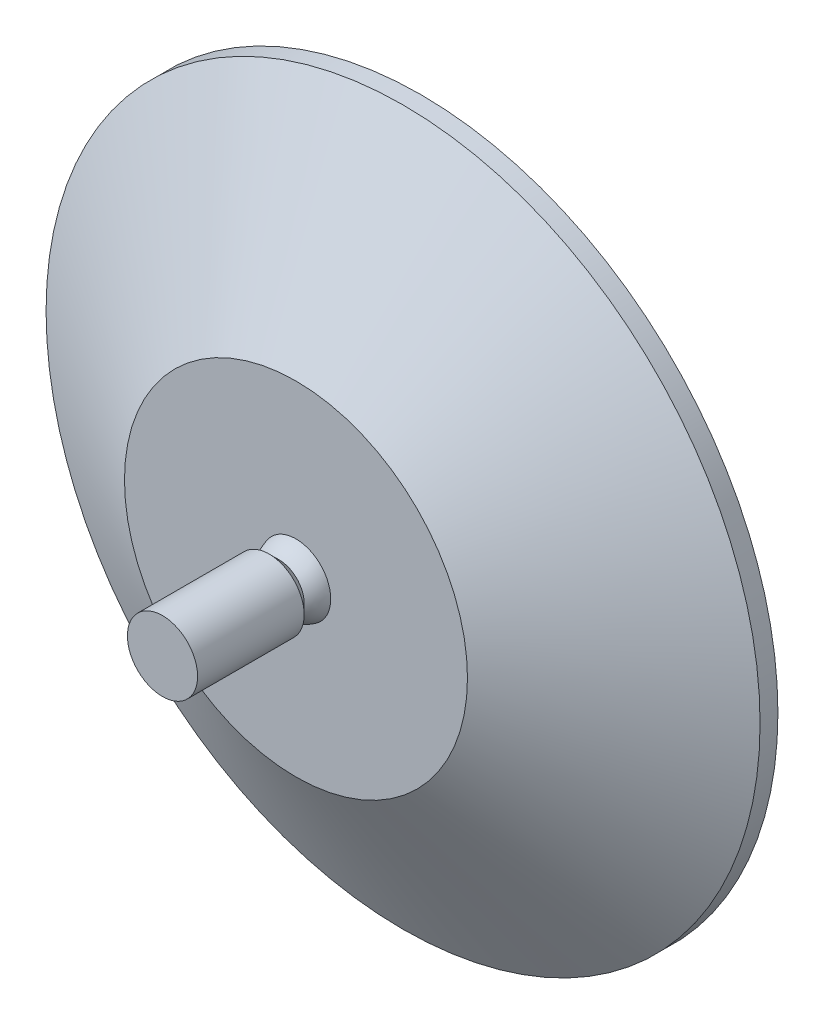
ISO-10303-21;
HEADER;
FILE_DESCRIPTION(('STEP AP214'),'2;1');
FILE_NAME('part.step','',(''),(''),'','','');
FILE_SCHEMA(('AUTOMOTIVE_DESIGN { 1 0 10303 214 1 1 1 1 }'));
ENDSEC;
DATA;
#1=APPLICATION_CONTEXT('core data for automotive mechanical design processes');
#2=APPLICATION_PROTOCOL_DEFINITION('international standard','automotive_design',2000,#1);
#3=PRODUCT_CONTEXT('',#1,'mechanical');
#4=PRODUCT('Part','Part','',(#3));
#5=PRODUCT_RELATED_PRODUCT_CATEGORY('part','',(#4));
#6=PRODUCT_DEFINITION_FORMATION('','',#4);
#7=PRODUCT_DEFINITION_CONTEXT('part definition',#1,'design');
#8=PRODUCT_DEFINITION('design','',#6,#7);
#9=PRODUCT_DEFINITION_SHAPE('','',#8);
#10=(LENGTH_UNIT() NAMED_UNIT(*) SI_UNIT(.MILLI.,.METRE.));
#11=(NAMED_UNIT(*) PLANE_ANGLE_UNIT() SI_UNIT($,.RADIAN.));
#12=(NAMED_UNIT(*) SI_UNIT($,.STERADIAN.) SOLID_ANGLE_UNIT());
#13=UNCERTAINTY_MEASURE_WITH_UNIT(LENGTH_MEASURE(1.E-05),#10,'distance_accuracy_value','');
#14=(GEOMETRIC_REPRESENTATION_CONTEXT(3) GLOBAL_UNCERTAINTY_ASSIGNED_CONTEXT((#13)) GLOBAL_UNIT_ASSIGNED_CONTEXT((#10,
#11,#12)) REPRESENTATION_CONTEXT('',''));
#15=CARTESIAN_POINT('',(0.,0.,0.));
#16=DIRECTION('',(0.,0.,1.));
#17=DIRECTION('',(1.,0.,0.));
#18=AXIS2_PLACEMENT_3D('',#15,#16,#17);
#19=CARTESIAN_POINT('',(0.,0.,2.));
#20=DIRECTION('',(0.,0.,-1.));
#21=DIRECTION('',(-1.,0.,0.));
#22=AXIS2_PLACEMENT_3D('',#19,#20,#21);
#23=CYLINDRICAL_SURFACE('',#22,40.);
#24=CARTESIAN_POINT('',(0.,0.,2.));
#25=DIRECTION('',(0.,0.,1.));
#26=DIRECTION('',(1.,0.,0.));
#27=AXIS2_PLACEMENT_3D('',#24,#25,#26);
#28=CIRCLE('',#27,40.);
#29=CARTESIAN_POINT('',(40.,0.,2.));
#30=VERTEX_POINT('',#29);
#31=EDGE_CURVE('E38',#30,#30,#28,.T.);
#32=ORIENTED_EDGE('',*,*,#31,.F.);
#33=EDGE_LOOP('',(#32));
#34=FACE_BOUND('',#33,.T.);
#35=CARTESIAN_POINT('',(0.,0.,0.));
#36=DIRECTION('',(0.,0.,1.));
#37=DIRECTION('',(1.,0.,0.));
#38=AXIS2_PLACEMENT_3D('',#35,#36,#37);
#39=CIRCLE('',#38,40.);
#40=CARTESIAN_POINT('',(40.,0.,0.));
#41=VERTEX_POINT('',#40);
#42=EDGE_CURVE('E42',#41,#41,#39,.T.);
#43=ORIENTED_EDGE('',*,*,#42,.T.);
#44=EDGE_LOOP('',(#43));
#45=FACE_BOUND('',#44,.T.);
#46=ADVANCED_FACE('F32',(#34,#45),#23,.T.);
#47=CARTESIAN_POINT('',(0.,0.,0.));
#48=DIRECTION('',(0.,0.,1.));
#49=DIRECTION('',(1.,0.,0.));
#50=AXIS2_PLACEMENT_3D('',#47,#48,#49);
#51=PLANE('',#50);
#52=ORIENTED_EDGE('',*,*,#42,.F.);
#53=EDGE_LOOP('',(#52));
#54=FACE_BOUND('',#53,.T.);
#55=ADVANCED_FACE('F80',(#54),#51,.F.);
#56=CARTESIAN_POINT('',(0.,0.,2.));
#57=DIRECTION('',(0.,0.,-1.));
#58=DIRECTION('',(1.,0.,0.));
#59=AXIS2_PLACEMENT_3D('',#56,#57,#58);
#60=CONICAL_SURFACE('',#59,40.,1.0471975511966);
#61=CARTESIAN_POINT('',(0.,0.,14.));
#62=DIRECTION('',(0.,0.,1.));
#63=DIRECTION('',(1.,0.,0.));
#64=AXIS2_PLACEMENT_3D('',#61,#62,#63);
#65=CIRCLE('',#64,19.2153903091734);
#66=CARTESIAN_POINT('',(19.2153903091734,0.,14.));
#67=VERTEX_POINT('',#66);
#68=EDGE_CURVE('E47',#67,#67,#65,.T.);
#69=ORIENTED_EDGE('',*,*,#68,.F.);
#70=EDGE_LOOP('',(#69));
#71=FACE_BOUND('',#70,.T.);
#72=ORIENTED_EDGE('',*,*,#31,.T.);
#73=EDGE_LOOP('',(#72));
#74=FACE_BOUND('',#73,.T.);
#75=ADVANCED_FACE('F76',(#71,#74),#60,.T.);
#76=CARTESIAN_POINT('',(0.,0.,14.));
#77=DIRECTION('',(0.,0.,1.));
#78=DIRECTION('',(1.,0.,0.));
#79=AXIS2_PLACEMENT_3D('',#76,#77,#78);
#80=PLANE('',#79);
#81=CARTESIAN_POINT('',(0.,0.,14.));
#82=DIRECTION('',(0.,0.,1.));
#83=DIRECTION('',(1.,0.,0.));
#84=AXIS2_PLACEMENT_3D('',#81,#82,#83);
#85=CIRCLE('',#84,3.89249573236021);
#86=CARTESIAN_POINT('',(3.89249573236021,0.,14.));
#87=VERTEX_POINT('',#86);
#88=EDGE_CURVE('E10',#87,#87,#85,.T.);
#89=ORIENTED_EDGE('',*,*,#88,.F.);
#90=EDGE_LOOP('',(#89));
#91=FACE_BOUND('',#90,.T.);
#92=ORIENTED_EDGE('',*,*,#68,.T.);
#93=EDGE_LOOP('',(#92));
#94=FACE_BOUND('',#93,.T.);
#95=ADVANCED_FACE('F67',(#91,#94),#80,.T.);
#96=CARTESIAN_POINT('',(0.,0.,13.0788719016567));
#97=DIRECTION('',(0.,0.,1.));
#98=DIRECTION('',(1.,0.,0.));
#99=AXIS2_PLACEMENT_3D('',#96,#97,#98);
#100=SPHERICAL_SURFACE('',#99,4.);
#101=ORIENTED_EDGE('',*,*,#88,.T.);
#102=EDGE_LOOP('',(#101));
#103=FACE_BOUND('',#102,.T.);
#104=CARTESIAN_POINT('',(0.,0.,15.9072990264029));
#105=DIRECTION('',(0.,0.,1.));
#106=DIRECTION('',(1.,0.,0.));
#107=AXIS2_PLACEMENT_3D('',#104,#105,#106);
#108=CIRCLE('',#107,2.82842712474624);
#109=CARTESIAN_POINT('',(2.82842712474622,0.,15.9072990264029));
#110=VERTEX_POINT('',#109);
#111=EDGE_CURVE('E57',#110,#110,#108,.T.);
#112=ORIENTED_EDGE('',*,*,#111,.F.);
#113=EDGE_LOOP('',(#112));
#114=FACE_BOUND('',#113,.T.);
#115=ADVANCED_FACE('F64',(#103,#114),#100,.T.);
#116=CARTESIAN_POINT('',(3.93204133475612,0.,28.9557608525079));
#117=DIRECTION('',(0.,0.,1.));
#118=DIRECTION('',(1.,0.,0.));
#119=AXIS2_PLACEMENT_3D('',#116,#117,#118);
#120=PLANE('',#119);
#121=CARTESIAN_POINT('',(0.,0.,28.9557608525079));
#122=DIRECTION('',(0.,0.,1.));
#123=DIRECTION('',(1.,0.,0.));
#124=AXIS2_PLACEMENT_3D('',#121,#122,#123);
#125=CIRCLE('',#124,3.93204133475614);
#126=CARTESIAN_POINT('',(3.93204133475612,0.,28.9557608525079));
#127=VERTEX_POINT('',#126);
#128=EDGE_CURVE('E51',#127,#127,#125,.T.);
#129=ORIENTED_EDGE('',*,*,#128,.T.);
#130=EDGE_LOOP('',(#129));
#131=FACE_BOUND('',#130,.T.);
#132=ADVANCED_FACE('F66',(#131),#120,.T.);
#133=CARTESIAN_POINT('',(0.,0.,28.9557608525079));
#134=DIRECTION('',(0.,0.,1.));
#135=DIRECTION('',(1.,0.,0.));
#136=AXIS2_PLACEMENT_3D('',#133,#134,#135);
#137=CYLINDRICAL_SURFACE('',#136,3.93204133475614);
#138=CARTESIAN_POINT('',(0.,0.,17.0109132364127));
#139=DIRECTION('',(0.,0.,1.));
#140=DIRECTION('',(1.,0.,0.));
#141=AXIS2_PLACEMENT_3D('',#138,#139,#140);
#142=CIRCLE('',#141,3.93204133475614);
#143=CARTESIAN_POINT('',(3.93204133475612,0.,17.0109132364127));
#144=VERTEX_POINT('',#143);
#145=EDGE_CURVE('E54',#144,#144,#142,.T.);
#146=ORIENTED_EDGE('',*,*,#145,.T.);
#147=EDGE_LOOP('',(#146));
#148=FACE_BOUND('',#147,.T.);
#149=ORIENTED_EDGE('',*,*,#128,.F.);
#150=EDGE_LOOP('',(#149));
#151=FACE_BOUND('',#150,.T.);
#152=ADVANCED_FACE('F73',(#148,#151),#137,.T.);
#153=CARTESIAN_POINT('',(0.,0.,17.0109132364127));
#154=DIRECTION('',(0.,0.,1.));
#155=DIRECTION('',(1.,0.,0.));
#156=AXIS2_PLACEMENT_3D('',#153,#154,#155);
#157=CONICAL_SURFACE('',#156,3.93204133475614,0.78539816339746);
#158=ORIENTED_EDGE('',*,*,#111,.T.);
#159=EDGE_LOOP('',(#158));
#160=FACE_BOUND('',#159,.T.);
#161=ORIENTED_EDGE('',*,*,#145,.F.);
#162=EDGE_LOOP('',(#161));
#163=FACE_BOUND('',#162,.T.);
#164=ADVANCED_FACE('F61',(#160,#163),#157,.T.);
#165=CLOSED_SHELL('',(#46,#55,#75,#95,#115,#132,#152,#164));
#166=MANIFOLD_SOLID_BREP('B2',#165);
#167=ADVANCED_BREP_SHAPE_REPRESENTATION('',(#18,#166),#14);
#168=SHAPE_DEFINITION_REPRESENTATION(#9,#167);
ENDSEC;
END-ISO-10303-21;
